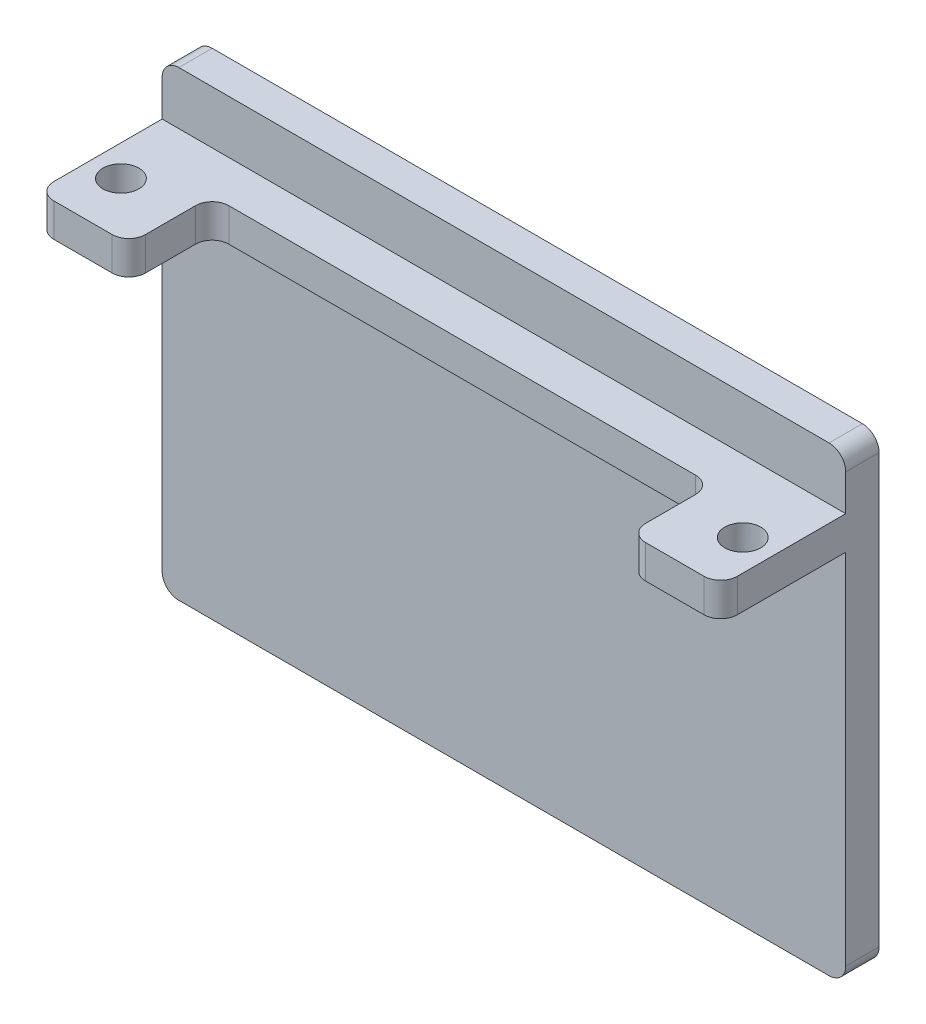
ISO-10303-21;
HEADER;
FILE_DESCRIPTION(('STEP AP214'),'2;1');
FILE_NAME('part.step','',(''),(''),'','','');
FILE_SCHEMA(('AUTOMOTIVE_DESIGN { 1 0 10303 214 1 1 1 1 }'));
ENDSEC;
DATA;
#1=APPLICATION_CONTEXT('core data for automotive mechanical design processes');
#2=APPLICATION_PROTOCOL_DEFINITION('international standard','automotive_design',2000,#1);
#3=PRODUCT_CONTEXT('',#1,'mechanical');
#4=PRODUCT('Part','Part','',(#3));
#5=PRODUCT_RELATED_PRODUCT_CATEGORY('part','',(#4));
#6=PRODUCT_DEFINITION_FORMATION('','',#4);
#7=PRODUCT_DEFINITION_CONTEXT('part definition',#1,'design');
#8=PRODUCT_DEFINITION('design','',#6,#7);
#9=PRODUCT_DEFINITION_SHAPE('','',#8);
#10=(LENGTH_UNIT() NAMED_UNIT(*) SI_UNIT(.MILLI.,.METRE.));
#11=(NAMED_UNIT(*) PLANE_ANGLE_UNIT() SI_UNIT($,.RADIAN.));
#12=(NAMED_UNIT(*) SI_UNIT($,.STERADIAN.) SOLID_ANGLE_UNIT());
#13=UNCERTAINTY_MEASURE_WITH_UNIT(LENGTH_MEASURE(1.E-05),#10,'distance_accuracy_value','');
#14=(GEOMETRIC_REPRESENTATION_CONTEXT(3) GLOBAL_UNCERTAINTY_ASSIGNED_CONTEXT((#13)) GLOBAL_UNIT_ASSIGNED_CONTEXT((#10,
#11,#12)) REPRESENTATION_CONTEXT('',''));
#15=CARTESIAN_POINT('',(0.,0.,0.));
#16=DIRECTION('',(0.,0.,1.));
#17=DIRECTION('',(1.,0.,0.));
#18=AXIS2_PLACEMENT_3D('',#15,#16,#17);
#19=CARTESIAN_POINT('',(0.,0.,19.));
#20=DIRECTION('',(0.,0.,1.));
#21=DIRECTION('',(1.,0.,0.));
#22=AXIS2_PLACEMENT_3D('',#19,#20,#21);
#23=PLANE('',#22);
#24=DIRECTION('',(1.,0.,0.));
#25=VECTOR('',#24,1.);
#26=CARTESIAN_POINT('',(0.,-4.,19.));
#27=LINE('',#26,#25);
#28=CARTESIAN_POINT('',(73.,-4.,19.));
#29=VERTEX_POINT('',#28);
#30=CARTESIAN_POINT('',(80.,-4.,19.));
#31=VERTEX_POINT('',#30);
#32=EDGE_CURVE('E228',#29,#31,#27,.T.);
#33=ORIENTED_EDGE('',*,*,#32,.T.);
#34=DIRECTION('',(0.,1.,0.));
#35=VECTOR('',#34,1.);
#36=CARTESIAN_POINT('',(80.,0.,19.));
#37=LINE('',#36,#35);
#38=CARTESIAN_POINT('',(80.,0.,19.));
#39=VERTEX_POINT('',#38);
#40=EDGE_CURVE('E325',#31,#39,#37,.T.);
#41=ORIENTED_EDGE('',*,*,#40,.T.);
#42=DIRECTION('',(-1.,0.,0.));
#43=VECTOR('',#42,1.);
#44=CARTESIAN_POINT('',(0.,0.,19.));
#45=LINE('',#44,#43);
#46=CARTESIAN_POINT('',(73.,0.,19.));
#47=VERTEX_POINT('',#46);
#48=EDGE_CURVE('E233',#39,#47,#45,.T.);
#49=ORIENTED_EDGE('',*,*,#48,.T.);
#50=DIRECTION('',(0.,1.,0.));
#51=VECTOR('',#50,1.);
#52=CARTESIAN_POINT('',(73.,-4.,19.));
#53=LINE('',#52,#51);
#54=EDGE_CURVE('E323',#47,#29,#53,.F.);
#55=ORIENTED_EDGE('',*,*,#54,.T.);
#56=EDGE_LOOP('',(#33,#41,#49,#55));
#57=FACE_BOUND('',#56,.T.);
#58=ADVANCED_FACE('F33',(#57),#23,.T.);
#59=CARTESIAN_POINT('',(0.,0.,4.));
#60=DIRECTION('',(0.,-1.,0.));
#61=DIRECTION('',(0.,0.,-1.));
#62=AXIS2_PLACEMENT_3D('',#59,#60,#61);
#63=PLANE('',#62);
#64=CARTESIAN_POINT('',(78.295166005,0.,12.65));
#65=DIRECTION('',(0.,1.,0.));
#66=DIRECTION('',(0.,0.,1.));
#67=AXIS2_PLACEMENT_3D('',#64,#65,#66);
#68=CIRCLE('',#67,2.15899999999999);
#69=CARTESIAN_POINT('',(78.295166005,0.,14.809));
#70=VERTEX_POINT('',#69);
#71=EDGE_CURVE('E221',#70,#70,#68,.T.);
#72=ORIENTED_EDGE('',*,*,#71,.F.);
#73=EDGE_LOOP('',(#72));
#74=FACE_BOUND('',#73,.T.);
#75=CARTESIAN_POINT('',(3.704833995,0.,12.65));
#76=DIRECTION('',(0.,1.,0.));
#77=DIRECTION('',(0.,0.,1.));
#78=AXIS2_PLACEMENT_3D('',#75,#76,#77);
#79=CIRCLE('',#78,2.159);
#80=CARTESIAN_POINT('',(3.704833995,0.,14.809));
#81=VERTEX_POINT('',#80);
#82=EDGE_CURVE('E222',#81,#81,#79,.T.);
#83=ORIENTED_EDGE('',*,*,#82,.F.);
#84=EDGE_LOOP('',(#83));
#85=FACE_BOUND('',#84,.T.);
#86=DIRECTION('',(0.,0.,-1.));
#87=VECTOR('',#86,1.);
#88=CARTESIAN_POINT('',(0.,0.,4.));
#89=LINE('',#88,#87);
#90=CARTESIAN_POINT('',(0.,0.,17.));
#91=VERTEX_POINT('',#90);
#92=CARTESIAN_POINT('',(0.,0.,4.));
#93=VERTEX_POINT('',#92);
#94=EDGE_CURVE('E193',#91,#93,#89,.T.);
#95=ORIENTED_EDGE('',*,*,#94,.F.);
#96=CARTESIAN_POINT('',(2.,0.,17.));
#97=DIRECTION('',(0.,-1.,0.));
#98=DIRECTION('',(0.,0.,-1.));
#99=AXIS2_PLACEMENT_3D('',#96,#97,#98);
#100=CIRCLE('',#99,2.);
#101=CARTESIAN_POINT('',(2.,0.,19.));
#102=VERTEX_POINT('',#101);
#103=EDGE_CURVE('E321',#91,#102,#100,.F.);
#104=ORIENTED_EDGE('',*,*,#103,.T.);
#105=CARTESIAN_POINT('',(9.00000000000001,0.,19.));
#106=VERTEX_POINT('',#105);
#107=EDGE_CURVE('E237',#106,#102,#45,.T.);
#108=ORIENTED_EDGE('',*,*,#107,.F.);
#109=CARTESIAN_POINT('',(9.00000000000001,0.,17.));
#110=DIRECTION('',(0.,-1.,0.));
#111=DIRECTION('',(0.,0.,-1.));
#112=AXIS2_PLACEMENT_3D('',#109,#110,#111);
#113=CIRCLE('',#112,2.);
#114=CARTESIAN_POINT('',(11.,0.,17.));
#115=VERTEX_POINT('',#114);
#116=EDGE_CURVE('E48',#106,#115,#113,.F.);
#117=ORIENTED_EDGE('',*,*,#116,.T.);
#118=DIRECTION('',(0.,0.,1.));
#119=VECTOR('',#118,1.);
#120=CARTESIAN_POINT('',(11.,0.,9.));
#121=LINE('',#120,#119);
#122=CARTESIAN_POINT('',(11.,0.,11.));
#123=VERTEX_POINT('',#122);
#124=EDGE_CURVE('E358',#123,#115,#121,.T.);
#125=ORIENTED_EDGE('',*,*,#124,.F.);
#126=CARTESIAN_POINT('',(13.,0.,11.));
#127=DIRECTION('',(0.,-1.,0.));
#128=DIRECTION('',(0.,0.,-1.));
#129=AXIS2_PLACEMENT_3D('',#126,#127,#128);
#130=CIRCLE('',#129,2.);
#131=CARTESIAN_POINT('',(13.,0.,9.));
#132=VERTEX_POINT('',#131);
#133=EDGE_CURVE('E11',#123,#132,#130,.T.);
#134=ORIENTED_EDGE('',*,*,#133,.T.);
#135=DIRECTION('',(-1.,0.,0.));
#136=VECTOR('',#135,1.);
#137=CARTESIAN_POINT('',(11.,0.,9.));
#138=LINE('',#137,#136);
#139=CARTESIAN_POINT('',(69.,0.,9.));
#140=VERTEX_POINT('',#139);
#141=EDGE_CURVE('E363',#140,#132,#138,.T.);
#142=ORIENTED_EDGE('',*,*,#141,.F.);
#143=CARTESIAN_POINT('',(69.,0.,11.));
#144=DIRECTION('',(0.,-1.,0.));
#145=DIRECTION('',(0.,0.,-1.));
#146=AXIS2_PLACEMENT_3D('',#143,#144,#145);
#147=CIRCLE('',#146,2.);
#148=CARTESIAN_POINT('',(71.,0.,11.));
#149=VERTEX_POINT('',#148);
#150=EDGE_CURVE('E343',#140,#149,#147,.T.);
#151=ORIENTED_EDGE('',*,*,#150,.T.);
#152=DIRECTION('',(0.,0.,1.));
#153=VECTOR('',#152,1.);
#154=CARTESIAN_POINT('',(71.,0.,9.));
#155=LINE('',#154,#153);
#156=CARTESIAN_POINT('',(71.,0.,17.));
#157=VERTEX_POINT('',#156);
#158=EDGE_CURVE('E368',#149,#157,#155,.T.);
#159=ORIENTED_EDGE('',*,*,#158,.T.);
#160=CARTESIAN_POINT('',(73.,0.,17.));
#161=DIRECTION('',(0.,-1.,0.));
#162=DIRECTION('',(0.,0.,-1.));
#163=AXIS2_PLACEMENT_3D('',#160,#161,#162);
#164=CIRCLE('',#163,2.);
#165=EDGE_CURVE('E318',#157,#47,#164,.F.);
#166=ORIENTED_EDGE('',*,*,#165,.T.);
#167=ORIENTED_EDGE('',*,*,#48,.F.);
#168=CARTESIAN_POINT('',(80.,0.,17.));
#169=DIRECTION('',(0.,-1.,0.));
#170=DIRECTION('',(0.,0.,-1.));
#171=AXIS2_PLACEMENT_3D('',#168,#169,#170);
#172=CIRCLE('',#171,2.);
#173=CARTESIAN_POINT('',(82.,0.,17.));
#174=VERTEX_POINT('',#173);
#175=EDGE_CURVE('E189',#39,#174,#172,.F.);
#176=ORIENTED_EDGE('',*,*,#175,.T.);
#177=DIRECTION('',(0.,0.,-1.));
#178=VECTOR('',#177,1.);
#179=CARTESIAN_POINT('',(82.,0.,4.));
#180=LINE('',#179,#178);
#181=CARTESIAN_POINT('',(82.,0.,4.));
#182=VERTEX_POINT('',#181);
#183=EDGE_CURVE('E182',#174,#182,#180,.T.);
#184=ORIENTED_EDGE('',*,*,#183,.T.);
#185=DIRECTION('',(1.,0.,0.));
#186=VECTOR('',#185,1.);
#187=CARTESIAN_POINT('',(0.,0.,4.));
#188=LINE('',#187,#186);
#189=EDGE_CURVE('E187',#93,#182,#188,.T.);
#190=ORIENTED_EDGE('',*,*,#189,.F.);
#191=EDGE_LOOP('',(#95,#104,#108,#117,#125,#134,#142,#151,#159,#166,#167,#176,#184,#190));
#192=FACE_BOUND('',#191,.T.);
#193=ADVANCED_FACE('F185',(#74,#85,#192),#63,.F.);
#194=CARTESIAN_POINT('',(0.,0.,4.));
#195=DIRECTION('',(1.,0.,0.));
#196=DIRECTION('',(0.,1.,0.));
#197=AXIS2_PLACEMENT_3D('',#194,#195,#196);
#198=PLANE('',#197);
#199=DIRECTION('',(0.,-1.,0.));
#200=VECTOR('',#199,1.);
#201=CARTESIAN_POINT('',(0.,0.,0.));
#202=LINE('',#201,#200);
#203=CARTESIAN_POINT('',(0.,4.35,0.));
#204=VERTEX_POINT('',#203);
#205=CARTESIAN_POINT('',(0.,-47.,0.));
#206=VERTEX_POINT('',#205);
#207=EDGE_CURVE('E244',#204,#206,#202,.T.);
#208=ORIENTED_EDGE('',*,*,#207,.T.);
#209=DIRECTION('',(0.,0.,-1.));
#210=VECTOR('',#209,1.);
#211=CARTESIAN_POINT('',(0.,-47.,4.));
#212=LINE('',#211,#210);
#213=CARTESIAN_POINT('',(0.,-47.,4.));
#214=VERTEX_POINT('',#213);
#215=EDGE_CURVE('E282',#206,#214,#212,.F.);
#216=ORIENTED_EDGE('',*,*,#215,.T.);
#217=DIRECTION('',(0.,-1.,0.));
#218=VECTOR('',#217,1.);
#219=CARTESIAN_POINT('',(0.,0.,4.));
#220=LINE('',#219,#218);
#221=CARTESIAN_POINT('',(0.,-4.,4.));
#222=VERTEX_POINT('',#221);
#223=EDGE_CURVE('E245',#222,#214,#220,.T.);
#224=ORIENTED_EDGE('',*,*,#223,.F.);
#225=DIRECTION('',(0.,0.,-1.));
#226=VECTOR('',#225,1.);
#227=CARTESIAN_POINT('',(0.,-4.,19.));
#228=LINE('',#227,#226);
#229=CARTESIAN_POINT('',(0.,-4.,17.));
#230=VERTEX_POINT('',#229);
#231=EDGE_CURVE('E242',#230,#222,#228,.T.);
#232=ORIENTED_EDGE('',*,*,#231,.F.);
#233=DIRECTION('',(0.,-1.,0.));
#234=VECTOR('',#233,1.);
#235=CARTESIAN_POINT('',(0.,0.,17.));
#236=LINE('',#235,#234);
#237=EDGE_CURVE('E278',#230,#91,#236,.F.);
#238=ORIENTED_EDGE('',*,*,#237,.T.);
#239=ORIENTED_EDGE('',*,*,#94,.T.);
#240=DIRECTION('',(0.,-1.,0.));
#241=VECTOR('',#240,1.);
#242=CARTESIAN_POINT('',(0.,6.35,4.));
#243=LINE('',#242,#241);
#244=CARTESIAN_POINT('',(0.,4.35,4.));
#245=VERTEX_POINT('',#244);
#246=EDGE_CURVE('E204',#245,#93,#243,.T.);
#247=ORIENTED_EDGE('',*,*,#246,.F.);
#248=DIRECTION('',(0.,0.,1.));
#249=VECTOR('',#248,1.);
#250=CARTESIAN_POINT('',(0.,4.35,0.));
#251=LINE('',#250,#249);
#252=EDGE_CURVE('E280',#245,#204,#251,.F.);
#253=ORIENTED_EDGE('',*,*,#252,.T.);
#254=EDGE_LOOP('',(#208,#216,#224,#232,#238,#239,#247,#253));
#255=FACE_BOUND('',#254,.T.);
#256=ADVANCED_FACE('F402',(#255),#198,.F.);
#257=CARTESIAN_POINT('',(0.,-49.,4.));
#258=DIRECTION('',(0.,1.,0.));
#259=DIRECTION('',(0.,0.,1.));
#260=AXIS2_PLACEMENT_3D('',#257,#258,#259);
#261=PLANE('',#260);
#262=DIRECTION('',(1.,0.,0.));
#263=VECTOR('',#262,1.);
#264=CARTESIAN_POINT('',(0.,-49.,4.));
#265=LINE('',#264,#263);
#266=CARTESIAN_POINT('',(2.00000000000001,-49.,4.));
#267=VERTEX_POINT('',#266);
#268=CARTESIAN_POINT('',(80.,-49.,4.));
#269=VERTEX_POINT('',#268);
#270=EDGE_CURVE('E248',#267,#269,#265,.T.);
#271=ORIENTED_EDGE('',*,*,#270,.F.);
#272=DIRECTION('',(0.,0.,-1.));
#273=VECTOR('',#272,1.);
#274=CARTESIAN_POINT('',(2.00000000000001,-49.,4.));
#275=LINE('',#274,#273);
#276=CARTESIAN_POINT('',(2.00000000000001,-49.,0.));
#277=VERTEX_POINT('',#276);
#278=EDGE_CURVE('E267',#267,#277,#275,.T.);
#279=ORIENTED_EDGE('',*,*,#278,.T.);
#280=DIRECTION('',(1.,0.,0.));
#281=VECTOR('',#280,1.);
#282=CARTESIAN_POINT('',(0.,-49.,0.));
#283=LINE('',#282,#281);
#284=CARTESIAN_POINT('',(80.,-49.,0.));
#285=VERTEX_POINT('',#284);
#286=EDGE_CURVE('E257',#277,#285,#283,.T.);
#287=ORIENTED_EDGE('',*,*,#286,.T.);
#288=DIRECTION('',(0.,0.,-1.));
#289=VECTOR('',#288,1.);
#290=CARTESIAN_POINT('',(80.,-49.,4.));
#291=LINE('',#290,#289);
#292=EDGE_CURVE('E192',#285,#269,#291,.F.);
#293=ORIENTED_EDGE('',*,*,#292,.T.);
#294=EDGE_LOOP('',(#271,#279,#287,#293));
#295=FACE_BOUND('',#294,.T.);
#296=ADVANCED_FACE('F450',(#295),#261,.F.);
#297=CARTESIAN_POINT('',(82.,0.,4.));
#298=DIRECTION('',(-1.,0.,0.));
#299=DIRECTION('',(0.,0.,1.));
#300=AXIS2_PLACEMENT_3D('',#297,#298,#299);
#301=PLANE('',#300);
#302=DIRECTION('',(0.,1.,0.));
#303=VECTOR('',#302,1.);
#304=CARTESIAN_POINT('',(82.,0.,4.));
#305=LINE('',#304,#303);
#306=CARTESIAN_POINT('',(82.,-47.,4.));
#307=VERTEX_POINT('',#306);
#308=CARTESIAN_POINT('',(82.,-4.,4.));
#309=VERTEX_POINT('',#308);
#310=EDGE_CURVE('E252',#307,#309,#305,.T.);
#311=ORIENTED_EDGE('',*,*,#310,.F.);
#312=DIRECTION('',(0.,0.,-1.));
#313=VECTOR('',#312,1.);
#314=CARTESIAN_POINT('',(82.,-47.,4.));
#315=LINE('',#314,#313);
#316=CARTESIAN_POINT('',(82.,-47.,0.));
#317=VERTEX_POINT('',#316);
#318=EDGE_CURVE('E291',#307,#317,#315,.T.);
#319=ORIENTED_EDGE('',*,*,#318,.T.);
#320=DIRECTION('',(0.,1.,0.));
#321=VECTOR('',#320,1.);
#322=CARTESIAN_POINT('',(82.,0.,0.));
#323=LINE('',#322,#321);
#324=CARTESIAN_POINT('',(82.,4.35,0.));
#325=VERTEX_POINT('',#324);
#326=EDGE_CURVE('E249',#317,#325,#323,.T.);
#327=ORIENTED_EDGE('',*,*,#326,.T.);
#328=DIRECTION('',(0.,0.,-1.));
#329=VECTOR('',#328,1.);
#330=CARTESIAN_POINT('',(82.,4.35,4.));
#331=LINE('',#330,#329);
#332=CARTESIAN_POINT('',(82.,4.35,4.));
#333=VERTEX_POINT('',#332);
#334=EDGE_CURVE('E201',#325,#333,#331,.F.);
#335=ORIENTED_EDGE('',*,*,#334,.T.);
#336=DIRECTION('',(0.,-1.,0.));
#337=VECTOR('',#336,1.);
#338=CARTESIAN_POINT('',(82.,6.35,4.));
#339=LINE('',#338,#337);
#340=EDGE_CURVE('E196',#333,#182,#339,.T.);
#341=ORIENTED_EDGE('',*,*,#340,.T.);
#342=ORIENTED_EDGE('',*,*,#183,.F.);
#343=DIRECTION('',(0.,1.,0.));
#344=VECTOR('',#343,1.);
#345=CARTESIAN_POINT('',(82.,-4.,17.));
#346=LINE('',#345,#344);
#347=CARTESIAN_POINT('',(82.,-4.,17.));
#348=VERTEX_POINT('',#347);
#349=EDGE_CURVE('E288',#174,#348,#346,.F.);
#350=ORIENTED_EDGE('',*,*,#349,.T.);
#351=DIRECTION('',(0.,0.,-1.));
#352=VECTOR('',#351,1.);
#353=CARTESIAN_POINT('',(82.,-4.,19.));
#354=LINE('',#353,#352);
#355=EDGE_CURVE('E236',#348,#309,#354,.T.);
#356=ORIENTED_EDGE('',*,*,#355,.T.);
#357=EDGE_LOOP('',(#311,#319,#327,#335,#341,#342,#350,#356));
#358=FACE_BOUND('',#357,.T.);
#359=ADVANCED_FACE('F198',(#358),#301,.F.);
#360=CARTESIAN_POINT('',(0.,0.,4.));
#361=DIRECTION('',(0.,0.,1.));
#362=DIRECTION('',(1.,0.,0.));
#363=AXIS2_PLACEMENT_3D('',#360,#361,#362);
#364=PLANE('',#363);
#365=ORIENTED_EDGE('',*,*,#223,.T.);
#366=CARTESIAN_POINT('',(2.00000000000001,-47.,4.));
#367=DIRECTION('',(0.,0.,1.));
#368=DIRECTION('',(1.,0.,0.));
#369=AXIS2_PLACEMENT_3D('',#366,#367,#368);
#370=CIRCLE('',#369,2.);
#371=EDGE_CURVE('E286',#214,#267,#370,.T.);
#372=ORIENTED_EDGE('',*,*,#371,.T.);
#373=ORIENTED_EDGE('',*,*,#270,.T.);
#374=CARTESIAN_POINT('',(80.,-47.,4.));
#375=DIRECTION('',(0.,0.,1.));
#376=DIRECTION('',(1.,0.,0.));
#377=AXIS2_PLACEMENT_3D('',#374,#375,#376);
#378=CIRCLE('',#377,2.);
#379=EDGE_CURVE('E284',#269,#307,#378,.T.);
#380=ORIENTED_EDGE('',*,*,#379,.T.);
#381=ORIENTED_EDGE('',*,*,#310,.T.);
#382=DIRECTION('',(1.,0.,0.));
#383=VECTOR('',#382,1.);
#384=CARTESIAN_POINT('',(0.,-4.,4.));
#385=LINE('',#384,#383);
#386=EDGE_CURVE('E232',#222,#309,#385,.T.);
#387=ORIENTED_EDGE('',*,*,#386,.F.);
#388=EDGE_LOOP('',(#365,#372,#373,#380,#381,#387));
#389=FACE_BOUND('',#388,.T.);
#390=ADVANCED_FACE('F396',(#389),#364,.T.);
#391=CARTESIAN_POINT('',(0.,0.,0.));
#392=DIRECTION('',(0.,0.,1.));
#393=DIRECTION('',(1.,0.,0.));
#394=AXIS2_PLACEMENT_3D('',#391,#392,#393);
#395=PLANE('',#394);
#396=ORIENTED_EDGE('',*,*,#286,.F.);
#397=CARTESIAN_POINT('',(2.00000000000001,-47.,0.));
#398=DIRECTION('',(0.,0.,1.));
#399=DIRECTION('',(1.,0.,0.));
#400=AXIS2_PLACEMENT_3D('',#397,#398,#399);
#401=CIRCLE('',#400,2.);
#402=EDGE_CURVE('E276',#277,#206,#401,.F.);
#403=ORIENTED_EDGE('',*,*,#402,.T.);
#404=ORIENTED_EDGE('',*,*,#207,.F.);
#405=CARTESIAN_POINT('',(2.,4.35,0.));
#406=DIRECTION('',(0.,0.,1.));
#407=DIRECTION('',(1.,0.,0.));
#408=AXIS2_PLACEMENT_3D('',#405,#406,#407);
#409=CIRCLE('',#408,2.);
#410=CARTESIAN_POINT('',(2.,6.35,0.));
#411=VERTEX_POINT('',#410);
#412=EDGE_CURVE('E270',#204,#411,#409,.F.);
#413=ORIENTED_EDGE('',*,*,#412,.T.);
#414=DIRECTION('',(-1.,0.,0.));
#415=VECTOR('',#414,1.);
#416=CARTESIAN_POINT('',(0.,6.35,0.));
#417=LINE('',#416,#415);
#418=CARTESIAN_POINT('',(80.,6.35,0.));
#419=VERTEX_POINT('',#418);
#420=EDGE_CURVE('E205',#419,#411,#417,.T.);
#421=ORIENTED_EDGE('',*,*,#420,.F.);
#422=CARTESIAN_POINT('',(80.,4.35,0.));
#423=DIRECTION('',(0.,0.,1.));
#424=DIRECTION('',(1.,0.,0.));
#425=AXIS2_PLACEMENT_3D('',#422,#423,#424);
#426=CIRCLE('',#425,2.);
#427=EDGE_CURVE('E272',#419,#325,#426,.F.);
#428=ORIENTED_EDGE('',*,*,#427,.T.);
#429=ORIENTED_EDGE('',*,*,#326,.F.);
#430=CARTESIAN_POINT('',(80.,-47.,0.));
#431=DIRECTION('',(0.,0.,1.));
#432=DIRECTION('',(1.,0.,0.));
#433=AXIS2_PLACEMENT_3D('',#430,#431,#432);
#434=CIRCLE('',#433,2.);
#435=EDGE_CURVE('E274',#317,#285,#434,.F.);
#436=ORIENTED_EDGE('',*,*,#435,.T.);
#437=EDGE_LOOP('',(#396,#403,#404,#413,#421,#428,#429,#436));
#438=FACE_BOUND('',#437,.T.);
#439=ADVANCED_FACE('F439',(#438),#395,.F.);
#440=CARTESIAN_POINT('',(0.,-4.,19.));
#441=DIRECTION('',(0.,1.,0.));
#442=DIRECTION('',(-1.,0.,0.));
#443=AXIS2_PLACEMENT_3D('',#440,#441,#442);
#444=PLANE('',#443);
#445=CARTESIAN_POINT('',(2.,-4.,19.));
#446=VERTEX_POINT('',#445);
#447=CARTESIAN_POINT('',(9.00000000000001,-4.,19.));
#448=VERTEX_POINT('',#447);
#449=EDGE_CURVE('E231',#446,#448,#27,.T.);
#450=ORIENTED_EDGE('',*,*,#449,.F.);
#451=CARTESIAN_POINT('',(2.,-4.,17.));
#452=DIRECTION('',(0.,1.,0.));
#453=DIRECTION('',(-1.,0.,0.));
#454=AXIS2_PLACEMENT_3D('',#451,#452,#453);
#455=CIRCLE('',#454,2.);
#456=EDGE_CURVE('E315',#446,#230,#455,.F.);
#457=ORIENTED_EDGE('',*,*,#456,.T.);
#458=ORIENTED_EDGE('',*,*,#231,.T.);
#459=ORIENTED_EDGE('',*,*,#386,.T.);
#460=ORIENTED_EDGE('',*,*,#355,.F.);
#461=CARTESIAN_POINT('',(80.,-4.,17.));
#462=DIRECTION('',(0.,1.,0.));
#463=DIRECTION('',(-1.,0.,0.));
#464=AXIS2_PLACEMENT_3D('',#461,#462,#463);
#465=CIRCLE('',#464,2.);
#466=EDGE_CURVE('E313',#348,#31,#465,.F.);
#467=ORIENTED_EDGE('',*,*,#466,.T.);
#468=ORIENTED_EDGE('',*,*,#32,.F.);
#469=CARTESIAN_POINT('',(73.,-4.,17.));
#470=DIRECTION('',(0.,1.,0.));
#471=DIRECTION('',(-1.,0.,0.));
#472=AXIS2_PLACEMENT_3D('',#469,#470,#471);
#473=CIRCLE('',#472,2.);
#474=CARTESIAN_POINT('',(71.,-4.,17.));
#475=VERTEX_POINT('',#474);
#476=EDGE_CURVE('E311',#29,#475,#473,.F.);
#477=ORIENTED_EDGE('',*,*,#476,.T.);
#478=DIRECTION('',(0.,0.,1.));
#479=VECTOR('',#478,1.);
#480=CARTESIAN_POINT('',(71.,-4.,9.));
#481=LINE('',#480,#479);
#482=CARTESIAN_POINT('',(71.,-4.,11.));
#483=VERTEX_POINT('',#482);
#484=EDGE_CURVE('E211',#483,#475,#481,.T.);
#485=ORIENTED_EDGE('',*,*,#484,.F.);
#486=CARTESIAN_POINT('',(69.,-4.,11.));
#487=DIRECTION('',(0.,1.,0.));
#488=DIRECTION('',(-1.,0.,0.));
#489=AXIS2_PLACEMENT_3D('',#486,#487,#488);
#490=CIRCLE('',#489,2.);
#491=CARTESIAN_POINT('',(69.,-4.,9.));
#492=VERTEX_POINT('',#491);
#493=EDGE_CURVE('E345',#483,#492,#490,.T.);
#494=ORIENTED_EDGE('',*,*,#493,.T.);
#495=DIRECTION('',(1.,0.,0.));
#496=VECTOR('',#495,1.);
#497=CARTESIAN_POINT('',(11.,-4.,9.));
#498=LINE('',#497,#496);
#499=CARTESIAN_POINT('',(13.,-4.,9.));
#500=VERTEX_POINT('',#499);
#501=EDGE_CURVE('E353',#500,#492,#498,.T.);
#502=ORIENTED_EDGE('',*,*,#501,.F.);
#503=CARTESIAN_POINT('',(13.,-4.,11.));
#504=DIRECTION('',(0.,1.,0.));
#505=DIRECTION('',(-1.,0.,0.));
#506=AXIS2_PLACEMENT_3D('',#503,#504,#505);
#507=CIRCLE('',#506,2.);
#508=CARTESIAN_POINT('',(11.,-4.,11.));
#509=VERTEX_POINT('',#508);
#510=EDGE_CURVE('E41',#500,#509,#507,.T.);
#511=ORIENTED_EDGE('',*,*,#510,.T.);
#512=DIRECTION('',(0.,0.,1.));
#513=VECTOR('',#512,1.);
#514=CARTESIAN_POINT('',(11.,-4.,9.));
#515=LINE('',#514,#513);
#516=CARTESIAN_POINT('',(11.,-4.,17.));
#517=VERTEX_POINT('',#516);
#518=EDGE_CURVE('E216',#509,#517,#515,.T.);
#519=ORIENTED_EDGE('',*,*,#518,.T.);
#520=CARTESIAN_POINT('',(9.00000000000001,-4.,17.));
#521=DIRECTION('',(0.,1.,0.));
#522=DIRECTION('',(-1.,0.,0.));
#523=AXIS2_PLACEMENT_3D('',#520,#521,#522);
#524=CIRCLE('',#523,2.);
#525=EDGE_CURVE('E309',#517,#448,#524,.F.);
#526=ORIENTED_EDGE('',*,*,#525,.T.);
#527=EDGE_LOOP('',(#450,#457,#458,#459,#460,#467,#468,#477,#485,#494,#502,#511,#519,#526));
#528=FACE_BOUND('',#527,.T.);
#529=CARTESIAN_POINT('',(3.704833995,-4.,12.65));
#530=DIRECTION('',(0.,1.,0.));
#531=DIRECTION('',(-1.,0.,0.));
#532=AXIS2_PLACEMENT_3D('',#529,#530,#531);
#533=CIRCLE('',#532,2.159);
#534=CARTESIAN_POINT('',(1.545833995,-4.,12.65));
#535=VERTEX_POINT('',#534);
#536=EDGE_CURVE('E240',#535,#535,#533,.T.);
#537=ORIENTED_EDGE('',*,*,#536,.T.);
#538=EDGE_LOOP('',(#537));
#539=FACE_BOUND('',#538,.T.);
#540=CARTESIAN_POINT('',(78.295166005,-4.,12.65));
#541=DIRECTION('',(0.,1.,0.));
#542=DIRECTION('',(-1.,0.,0.));
#543=AXIS2_PLACEMENT_3D('',#540,#541,#542);
#544=CIRCLE('',#543,2.15899999999999);
#545=CARTESIAN_POINT('',(76.136166005,-4.,12.65));
#546=VERTEX_POINT('',#545);
#547=EDGE_CURVE('E225',#546,#546,#544,.T.);
#548=ORIENTED_EDGE('',*,*,#547,.T.);
#549=EDGE_LOOP('',(#548));
#550=FACE_BOUND('',#549,.T.);
#551=ADVANCED_FACE('F350',(#528,#539,#550),#444,.F.);
#552=ORIENTED_EDGE('',*,*,#107,.T.);
#553=DIRECTION('',(0.,-1.,0.));
#554=VECTOR('',#553,1.);
#555=CARTESIAN_POINT('',(2.,-4.,19.));
#556=LINE('',#555,#554);
#557=EDGE_CURVE('E306',#102,#446,#556,.T.);
#558=ORIENTED_EDGE('',*,*,#557,.T.);
#559=ORIENTED_EDGE('',*,*,#449,.T.);
#560=DIRECTION('',(0.,-1.,0.));
#561=VECTOR('',#560,1.);
#562=CARTESIAN_POINT('',(9.00000000000001,0.,19.));
#563=LINE('',#562,#561);
#564=EDGE_CURVE('E304',#448,#106,#563,.F.);
#565=ORIENTED_EDGE('',*,*,#564,.T.);
#566=EDGE_LOOP('',(#552,#558,#559,#565));
#567=FACE_BOUND('',#566,.T.);
#568=ADVANCED_FACE('F409',(#567),#23,.T.);
#569=CARTESIAN_POINT('',(78.295166005,-49.,12.65));
#570=DIRECTION('',(0.,1.,0.));
#571=DIRECTION('',(0.,0.,1.));
#572=AXIS2_PLACEMENT_3D('',#569,#570,#571);
#573=CYLINDRICAL_SURFACE('',#572,2.15899999999999);
#574=ORIENTED_EDGE('',*,*,#71,.T.);
#575=EDGE_LOOP('',(#574));
#576=FACE_BOUND('',#575,.T.);
#577=ORIENTED_EDGE('',*,*,#547,.F.);
#578=EDGE_LOOP('',(#577));
#579=FACE_BOUND('',#578,.T.);
#580=ADVANCED_FACE('F431',(#576,#579),#573,.F.);
#581=CARTESIAN_POINT('',(3.704833995,-49.,12.65));
#582=DIRECTION('',(0.,1.,0.));
#583=DIRECTION('',(0.,0.,1.));
#584=AXIS2_PLACEMENT_3D('',#581,#582,#583);
#585=CYLINDRICAL_SURFACE('',#584,2.159);
#586=ORIENTED_EDGE('',*,*,#82,.T.);
#587=EDGE_LOOP('',(#586));
#588=FACE_BOUND('',#587,.T.);
#589=ORIENTED_EDGE('',*,*,#536,.F.);
#590=EDGE_LOOP('',(#589));
#591=FACE_BOUND('',#590,.T.);
#592=ADVANCED_FACE('F437',(#588,#591),#585,.F.);
#593=CARTESIAN_POINT('',(0.,6.35,4.));
#594=DIRECTION('',(0.,0.,-1.));
#595=DIRECTION('',(-1.,0.,0.));
#596=AXIS2_PLACEMENT_3D('',#593,#594,#595);
#597=PLANE('',#596);
#598=ORIENTED_EDGE('',*,*,#340,.F.);
#599=CARTESIAN_POINT('',(80.,4.35,4.));
#600=DIRECTION('',(0.,0.,-1.));
#601=DIRECTION('',(-1.,0.,0.));
#602=AXIS2_PLACEMENT_3D('',#599,#600,#601);
#603=CIRCLE('',#602,2.);
#604=CARTESIAN_POINT('',(80.,6.35,4.));
#605=VERTEX_POINT('',#604);
#606=EDGE_CURVE('E302',#333,#605,#603,.F.);
#607=ORIENTED_EDGE('',*,*,#606,.T.);
#608=DIRECTION('',(1.,0.,0.));
#609=VECTOR('',#608,1.);
#610=CARTESIAN_POINT('',(0.,6.35,4.));
#611=LINE('',#610,#609);
#612=CARTESIAN_POINT('',(2.,6.35,4.));
#613=VERTEX_POINT('',#612);
#614=EDGE_CURVE('E210',#613,#605,#611,.T.);
#615=ORIENTED_EDGE('',*,*,#614,.F.);
#616=CARTESIAN_POINT('',(2.,4.35,4.));
#617=DIRECTION('',(0.,0.,-1.));
#618=DIRECTION('',(-1.,0.,0.));
#619=AXIS2_PLACEMENT_3D('',#616,#617,#618);
#620=CIRCLE('',#619,2.);
#621=EDGE_CURVE('E300',#613,#245,#620,.F.);
#622=ORIENTED_EDGE('',*,*,#621,.T.);
#623=ORIENTED_EDGE('',*,*,#246,.T.);
#624=ORIENTED_EDGE('',*,*,#189,.T.);
#625=EDGE_LOOP('',(#598,#607,#615,#622,#623,#624));
#626=FACE_BOUND('',#625,.T.);
#627=ADVANCED_FACE('F207',(#626),#597,.F.);
#628=CARTESIAN_POINT('',(0.,6.35,0.));
#629=DIRECTION('',(0.,1.,0.));
#630=DIRECTION('',(0.,0.,1.));
#631=AXIS2_PLACEMENT_3D('',#628,#629,#630);
#632=PLANE('',#631);
#633=ORIENTED_EDGE('',*,*,#614,.T.);
#634=DIRECTION('',(0.,0.,-1.));
#635=VECTOR('',#634,1.);
#636=CARTESIAN_POINT('',(80.,6.35,0.));
#637=LINE('',#636,#635);
#638=EDGE_CURVE('E297',#605,#419,#637,.T.);
#639=ORIENTED_EDGE('',*,*,#638,.T.);
#640=ORIENTED_EDGE('',*,*,#420,.T.);
#641=DIRECTION('',(0.,0.,1.));
#642=VECTOR('',#641,1.);
#643=CARTESIAN_POINT('',(2.,6.35,4.));
#644=LINE('',#643,#642);
#645=EDGE_CURVE('E294',#411,#613,#644,.T.);
#646=ORIENTED_EDGE('',*,*,#645,.T.);
#647=EDGE_LOOP('',(#633,#639,#640,#646));
#648=FACE_BOUND('',#647,.T.);
#649=ADVANCED_FACE('F549',(#648),#632,.T.);
#650=CARTESIAN_POINT('',(71.,-4.,9.));
#651=DIRECTION('',(1.,0.,0.));
#652=DIRECTION('',(0.,0.,-1.));
#653=AXIS2_PLACEMENT_3D('',#650,#651,#652);
#654=PLANE('',#653);
#655=ORIENTED_EDGE('',*,*,#484,.T.);
#656=DIRECTION('',(0.,1.,0.));
#657=VECTOR('',#656,1.);
#658=CARTESIAN_POINT('',(71.,0.,17.));
#659=LINE('',#658,#657);
#660=EDGE_CURVE('E330',#475,#157,#659,.T.);
#661=ORIENTED_EDGE('',*,*,#660,.T.);
#662=ORIENTED_EDGE('',*,*,#158,.F.);
#663=DIRECTION('',(0.,1.,0.));
#664=VECTOR('',#663,1.);
#665=CARTESIAN_POINT('',(71.,-4.,11.));
#666=LINE('',#665,#664);
#667=EDGE_CURVE('E328',#149,#483,#666,.F.);
#668=ORIENTED_EDGE('',*,*,#667,.T.);
#669=EDGE_LOOP('',(#655,#661,#662,#668));
#670=FACE_BOUND('',#669,.T.);
#671=ADVANCED_FACE('F376',(#670),#654,.F.);
#672=CARTESIAN_POINT('',(11.,-4.,9.));
#673=DIRECTION('',(-1.,0.,0.));
#674=DIRECTION('',(0.,0.,1.));
#675=AXIS2_PLACEMENT_3D('',#672,#673,#674);
#676=PLANE('',#675);
#677=ORIENTED_EDGE('',*,*,#124,.T.);
#678=DIRECTION('',(0.,-1.,0.));
#679=VECTOR('',#678,1.);
#680=CARTESIAN_POINT('',(11.,-4.,17.));
#681=LINE('',#680,#679);
#682=EDGE_CURVE('E340',#115,#517,#681,.T.);
#683=ORIENTED_EDGE('',*,*,#682,.T.);
#684=ORIENTED_EDGE('',*,*,#518,.F.);
#685=DIRECTION('',(0.,-1.,0.));
#686=VECTOR('',#685,1.);
#687=CARTESIAN_POINT('',(11.,0.,11.));
#688=LINE('',#687,#686);
#689=EDGE_CURVE('E55',#509,#123,#688,.F.);
#690=ORIENTED_EDGE('',*,*,#689,.T.);
#691=EDGE_LOOP('',(#677,#683,#684,#690));
#692=FACE_BOUND('',#691,.T.);
#693=ADVANCED_FACE('F356',(#692),#676,.F.);
#694=CARTESIAN_POINT('',(0.,0.,9.));
#695=DIRECTION('',(0.,0.,-1.));
#696=DIRECTION('',(-1.,0.,0.));
#697=AXIS2_PLACEMENT_3D('',#694,#695,#696);
#698=PLANE('',#697);
#699=ORIENTED_EDGE('',*,*,#501,.T.);
#700=DIRECTION('',(0.,1.,0.));
#701=VECTOR('',#700,1.);
#702=CARTESIAN_POINT('',(69.,0.,9.));
#703=LINE('',#702,#701);
#704=EDGE_CURVE('E336',#492,#140,#703,.T.);
#705=ORIENTED_EDGE('',*,*,#704,.T.);
#706=ORIENTED_EDGE('',*,*,#141,.T.);
#707=DIRECTION('',(0.,-1.,0.));
#708=VECTOR('',#707,1.);
#709=CARTESIAN_POINT('',(13.,-4.,9.));
#710=LINE('',#709,#708);
#711=EDGE_CURVE('E333',#132,#500,#710,.T.);
#712=ORIENTED_EDGE('',*,*,#711,.T.);
#713=EDGE_LOOP('',(#699,#705,#706,#712));
#714=FACE_BOUND('',#713,.T.);
#715=ADVANCED_FACE('F365',(#714),#698,.F.);
#716=CARTESIAN_POINT('',(2.00000000000001,-47.,4.));
#717=DIRECTION('',(0.,0.,-1.));
#718=DIRECTION('',(-1.,0.,0.));
#719=AXIS2_PLACEMENT_3D('',#716,#717,#718);
#720=CYLINDRICAL_SURFACE('',#719,2.);
#721=ORIENTED_EDGE('',*,*,#371,.F.);
#722=ORIENTED_EDGE('',*,*,#215,.F.);
#723=ORIENTED_EDGE('',*,*,#402,.F.);
#724=ORIENTED_EDGE('',*,*,#278,.F.);
#725=EDGE_LOOP('',(#721,#722,#723,#724));
#726=FACE_BOUND('',#725,.T.);
#727=ADVANCED_FACE('F456',(#726),#720,.T.);
#728=CARTESIAN_POINT('',(80.,-47.,4.));
#729=DIRECTION('',(0.,0.,-1.));
#730=DIRECTION('',(-1.,0.,0.));
#731=AXIS2_PLACEMENT_3D('',#728,#729,#730);
#732=CYLINDRICAL_SURFACE('',#731,2.);
#733=ORIENTED_EDGE('',*,*,#379,.F.);
#734=ORIENTED_EDGE('',*,*,#292,.F.);
#735=ORIENTED_EDGE('',*,*,#435,.F.);
#736=ORIENTED_EDGE('',*,*,#318,.F.);
#737=EDGE_LOOP('',(#733,#734,#735,#736));
#738=FACE_BOUND('',#737,.T.);
#739=ADVANCED_FACE('F459',(#738),#732,.T.);
#740=CARTESIAN_POINT('',(80.,4.35,0.));
#741=DIRECTION('',(0.,0.,1.));
#742=DIRECTION('',(1.,0.,0.));
#743=AXIS2_PLACEMENT_3D('',#740,#741,#742);
#744=CYLINDRICAL_SURFACE('',#743,2.);
#745=ORIENTED_EDGE('',*,*,#606,.F.);
#746=ORIENTED_EDGE('',*,*,#334,.F.);
#747=ORIENTED_EDGE('',*,*,#427,.F.);
#748=ORIENTED_EDGE('',*,*,#638,.F.);
#749=EDGE_LOOP('',(#745,#746,#747,#748));
#750=FACE_BOUND('',#749,.T.);
#751=ADVANCED_FACE('F463',(#750),#744,.T.);
#752=CARTESIAN_POINT('',(2.,4.35,0.));
#753=DIRECTION('',(0.,0.,-1.));
#754=DIRECTION('',(-1.,0.,0.));
#755=AXIS2_PLACEMENT_3D('',#752,#753,#754);
#756=CYLINDRICAL_SURFACE('',#755,2.);
#757=ORIENTED_EDGE('',*,*,#412,.F.);
#758=ORIENTED_EDGE('',*,*,#252,.F.);
#759=ORIENTED_EDGE('',*,*,#621,.F.);
#760=ORIENTED_EDGE('',*,*,#645,.F.);
#761=EDGE_LOOP('',(#757,#758,#759,#760));
#762=FACE_BOUND('',#761,.T.);
#763=ADVANCED_FACE('F467',(#762),#756,.T.);
#764=CARTESIAN_POINT('',(2.,0.,17.));
#765=DIRECTION('',(0.,1.,0.));
#766=DIRECTION('',(-1.,0.,0.));
#767=AXIS2_PLACEMENT_3D('',#764,#765,#766);
#768=CYLINDRICAL_SURFACE('',#767,2.);
#769=ORIENTED_EDGE('',*,*,#103,.F.);
#770=ORIENTED_EDGE('',*,*,#237,.F.);
#771=ORIENTED_EDGE('',*,*,#456,.F.);
#772=ORIENTED_EDGE('',*,*,#557,.F.);
#773=EDGE_LOOP('',(#769,#770,#771,#772));
#774=FACE_BOUND('',#773,.T.);
#775=ADVANCED_FACE('F405',(#774),#768,.T.);
#776=CARTESIAN_POINT('',(80.,0.,17.));
#777=DIRECTION('',(0.,-1.,0.));
#778=DIRECTION('',(0.,0.,-1.));
#779=AXIS2_PLACEMENT_3D('',#776,#777,#778);
#780=CYLINDRICAL_SURFACE('',#779,2.);
#781=ORIENTED_EDGE('',*,*,#466,.F.);
#782=ORIENTED_EDGE('',*,*,#349,.F.);
#783=ORIENTED_EDGE('',*,*,#175,.F.);
#784=ORIENTED_EDGE('',*,*,#40,.F.);
#785=EDGE_LOOP('',(#781,#782,#783,#784));
#786=FACE_BOUND('',#785,.T.);
#787=ADVANCED_FACE('F392',(#786),#780,.T.);
#788=CARTESIAN_POINT('',(73.,-4.,17.));
#789=DIRECTION('',(0.,-1.,0.));
#790=DIRECTION('',(0.,0.,-1.));
#791=AXIS2_PLACEMENT_3D('',#788,#789,#790);
#792=CYLINDRICAL_SURFACE('',#791,2.);
#793=ORIENTED_EDGE('',*,*,#476,.F.);
#794=ORIENTED_EDGE('',*,*,#54,.F.);
#795=ORIENTED_EDGE('',*,*,#165,.F.);
#796=ORIENTED_EDGE('',*,*,#660,.F.);
#797=EDGE_LOOP('',(#793,#794,#795,#796));
#798=FACE_BOUND('',#797,.T.);
#799=ADVANCED_FACE('F385',(#798),#792,.T.);
#800=CARTESIAN_POINT('',(69.,0.,11.));
#801=DIRECTION('',(0.,-1.,0.));
#802=DIRECTION('',(0.,0.,-1.));
#803=AXIS2_PLACEMENT_3D('',#800,#801,#802);
#804=CYLINDRICAL_SURFACE('',#803,2.);
#805=ORIENTED_EDGE('',*,*,#493,.F.);
#806=ORIENTED_EDGE('',*,*,#667,.F.);
#807=ORIENTED_EDGE('',*,*,#150,.F.);
#808=ORIENTED_EDGE('',*,*,#704,.F.);
#809=EDGE_LOOP('',(#805,#806,#807,#808));
#810=FACE_BOUND('',#809,.T.);
#811=ADVANCED_FACE('F381',(#810),#804,.F.);
#812=CARTESIAN_POINT('',(9.00000000000001,-4.,17.));
#813=DIRECTION('',(0.,1.,0.));
#814=DIRECTION('',(0.,0.,1.));
#815=AXIS2_PLACEMENT_3D('',#812,#813,#814);
#816=CYLINDRICAL_SURFACE('',#815,2.);
#817=ORIENTED_EDGE('',*,*,#116,.F.);
#818=ORIENTED_EDGE('',*,*,#564,.F.);
#819=ORIENTED_EDGE('',*,*,#525,.F.);
#820=ORIENTED_EDGE('',*,*,#682,.F.);
#821=EDGE_LOOP('',(#817,#818,#819,#820));
#822=FACE_BOUND('',#821,.T.);
#823=ADVANCED_FACE('F413',(#822),#816,.T.);
#824=CARTESIAN_POINT('',(13.,0.,11.));
#825=DIRECTION('',(0.,1.,0.));
#826=DIRECTION('',(0.,0.,1.));
#827=AXIS2_PLACEMENT_3D('',#824,#825,#826);
#828=CYLINDRICAL_SURFACE('',#827,2.);
#829=ORIENTED_EDGE('',*,*,#133,.F.);
#830=ORIENTED_EDGE('',*,*,#689,.F.);
#831=ORIENTED_EDGE('',*,*,#510,.F.);
#832=ORIENTED_EDGE('',*,*,#711,.F.);
#833=EDGE_LOOP('',(#829,#830,#831,#832));
#834=FACE_BOUND('',#833,.T.);
#835=ADVANCED_FACE('F35',(#834),#828,.F.);
#836=CLOSED_SHELL('',(#58,#193,#256,#296,#359,#390,#439,#551,#568,#580,#592,#627,#649,#671,#693,
#715,#727,#739,#751,#763,#775,#787,#799,#811,#823,#835));
#837=MANIFOLD_SOLID_BREP('B2',#836);
#838=ADVANCED_BREP_SHAPE_REPRESENTATION('',(#18,#837),#14);
#839=SHAPE_DEFINITION_REPRESENTATION(#9,#838);
ENDSEC;
END-ISO-10303-21;
